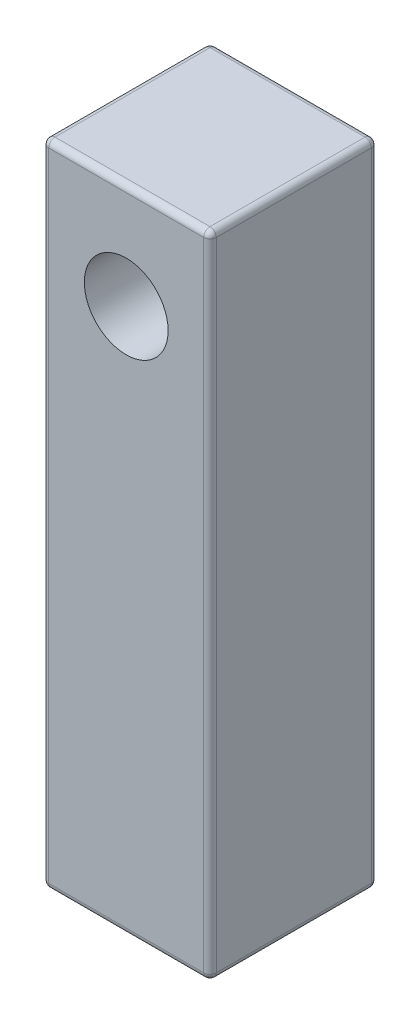
ISO-10303-21;
HEADER;
FILE_DESCRIPTION(('STEP AP214'),'2;1');
FILE_NAME('part.step','',(''),(''),'','','');
FILE_SCHEMA(('AUTOMOTIVE_DESIGN { 1 0 10303 214 1 1 1 1 }'));
ENDSEC;
DATA;
#1=APPLICATION_CONTEXT('core data for automotive mechanical design processes');
#2=APPLICATION_PROTOCOL_DEFINITION('international standard','automotive_design',2000,#1);
#3=PRODUCT_CONTEXT('',#1,'mechanical');
#4=PRODUCT('Part','Part','',(#3));
#5=PRODUCT_RELATED_PRODUCT_CATEGORY('part','',(#4));
#6=PRODUCT_DEFINITION_FORMATION('','',#4);
#7=PRODUCT_DEFINITION_CONTEXT('part definition',#1,'design');
#8=PRODUCT_DEFINITION('design','',#6,#7);
#9=PRODUCT_DEFINITION_SHAPE('','',#8);
#10=(LENGTH_UNIT() NAMED_UNIT(*) SI_UNIT(.MILLI.,.METRE.));
#11=(NAMED_UNIT(*) PLANE_ANGLE_UNIT() SI_UNIT($,.RADIAN.));
#12=(NAMED_UNIT(*) SI_UNIT($,.STERADIAN.) SOLID_ANGLE_UNIT());
#13=UNCERTAINTY_MEASURE_WITH_UNIT(LENGTH_MEASURE(1.E-05),#10,'distance_accuracy_value','');
#14=(GEOMETRIC_REPRESENTATION_CONTEXT(3) GLOBAL_UNCERTAINTY_ASSIGNED_CONTEXT((#13)) GLOBAL_UNIT_ASSIGNED_CONTEXT((#10,
#11,#12)) REPRESENTATION_CONTEXT('',''));
#15=CARTESIAN_POINT('',(0.,0.,0.));
#16=DIRECTION('',(0.,0.,1.));
#17=DIRECTION('',(1.,0.,0.));
#18=AXIS2_PLACEMENT_3D('',#15,#16,#17);
#19=CARTESIAN_POINT('',(4.,31.,-4.));
#20=DIRECTION('',(-1.,0.,0.));
#21=DIRECTION('',(0.,0.,1.));
#22=AXIS2_PLACEMENT_3D('',#19,#20,#21);
#23=PLANE('',#22);
#24=DIRECTION('',(0.,0.,-1.));
#25=VECTOR('',#24,1.);
#26=CARTESIAN_POINT('',(4.,30.7,4.));
#27=LINE('',#26,#25);
#28=CARTESIAN_POINT('',(4.,30.7,-3.7));
#29=VERTEX_POINT('',#28);
#30=CARTESIAN_POINT('',(4.,30.7,3.7));
#31=VERTEX_POINT('',#30);
#32=EDGE_CURVE('E161',#29,#31,#27,.F.);
#33=ORIENTED_EDGE('',*,*,#32,.T.);
#34=DIRECTION('',(0.,-1.,0.));
#35=VECTOR('',#34,1.);
#36=CARTESIAN_POINT('',(4.,31.,3.7));
#37=LINE('',#36,#35);
#38=CARTESIAN_POINT('',(4.,0.300000000000002,3.7));
#39=VERTEX_POINT('',#38);
#40=EDGE_CURVE('E164',#31,#39,#37,.T.);
#41=ORIENTED_EDGE('',*,*,#40,.T.);
#42=DIRECTION('',(0.,0.,-1.));
#43=VECTOR('',#42,1.);
#44=CARTESIAN_POINT('',(4.,0.300000000000002,-4.));
#45=LINE('',#44,#43);
#46=CARTESIAN_POINT('',(4.,0.300000000000002,-3.7));
#47=VERTEX_POINT('',#46);
#48=EDGE_CURVE('E136',#39,#47,#45,.T.);
#49=ORIENTED_EDGE('',*,*,#48,.T.);
#50=DIRECTION('',(0.,-1.,0.));
#51=VECTOR('',#50,1.);
#52=CARTESIAN_POINT('',(4.,31.,-3.7));
#53=LINE('',#52,#51);
#54=EDGE_CURVE('E155',#47,#29,#53,.F.);
#55=ORIENTED_EDGE('',*,*,#54,.T.);
#56=EDGE_LOOP('',(#33,#41,#49,#55));
#57=FACE_BOUND('',#56,.T.);
#58=ADVANCED_FACE('F39',(#57),#23,.F.);
#59=CARTESIAN_POINT('',(-4.,31.,-4.));
#60=DIRECTION('',(0.,0.,1.));
#61=DIRECTION('',(1.,0.,0.));
#62=AXIS2_PLACEMENT_3D('',#59,#60,#61);
#63=PLANE('',#62);
#64=CARTESIAN_POINT('',(0.,26.,-4.));
#65=DIRECTION('',(0.,0.,1.));
#66=DIRECTION('',(1.,0.,0.));
#67=AXIS2_PLACEMENT_3D('',#64,#65,#66);
#68=CIRCLE('',#67,2.);
#69=CARTESIAN_POINT('',(2.,26.,-4.));
#70=VERTEX_POINT('',#69);
#71=EDGE_CURVE('E142',#70,#70,#68,.T.);
#72=ORIENTED_EDGE('',*,*,#71,.T.);
#73=EDGE_LOOP('',(#72));
#74=FACE_BOUND('',#73,.T.);
#75=DIRECTION('',(-1.,0.,0.));
#76=VECTOR('',#75,1.);
#77=CARTESIAN_POINT('',(-4.,0.300000000000002,-4.));
#78=LINE('',#77,#76);
#79=CARTESIAN_POINT('',(3.7,0.300000000000002,-4.));
#80=VERTEX_POINT('',#79);
#81=CARTESIAN_POINT('',(-3.7,0.300000000000002,-4.));
#82=VERTEX_POINT('',#81);
#83=EDGE_CURVE('E183',#80,#82,#78,.T.);
#84=ORIENTED_EDGE('',*,*,#83,.T.);
#85=DIRECTION('',(0.,-1.,0.));
#86=VECTOR('',#85,1.);
#87=CARTESIAN_POINT('',(-3.7,31.,-4.));
#88=LINE('',#87,#86);
#89=CARTESIAN_POINT('',(-3.7,30.7,-4.));
#90=VERTEX_POINT('',#89);
#91=EDGE_CURVE('E186',#82,#90,#88,.F.);
#92=ORIENTED_EDGE('',*,*,#91,.T.);
#93=DIRECTION('',(-1.,0.,0.));
#94=VECTOR('',#93,1.);
#95=CARTESIAN_POINT('',(4.,30.7,-4.));
#96=LINE('',#95,#94);
#97=CARTESIAN_POINT('',(3.7,30.7,-4.));
#98=VERTEX_POINT('',#97);
#99=EDGE_CURVE('E181',#90,#98,#96,.F.);
#100=ORIENTED_EDGE('',*,*,#99,.T.);
#101=DIRECTION('',(0.,-1.,0.));
#102=VECTOR('',#101,1.);
#103=CARTESIAN_POINT('',(3.7,31.,-4.));
#104=LINE('',#103,#102);
#105=EDGE_CURVE('E178',#98,#80,#104,.T.);
#106=ORIENTED_EDGE('',*,*,#105,.T.);
#107=EDGE_LOOP('',(#84,#92,#100,#106));
#108=FACE_BOUND('',#107,.T.);
#109=ADVANCED_FACE('F338',(#74,#108),#63,.F.);
#110=CARTESIAN_POINT('',(-4.,31.,-4.));
#111=DIRECTION('',(1.,0.,0.));
#112=DIRECTION('',(0.,0.,-1.));
#113=AXIS2_PLACEMENT_3D('',#110,#111,#112);
#114=PLANE('',#113);
#115=DIRECTION('',(0.,0.,1.));
#116=VECTOR('',#115,1.);
#117=CARTESIAN_POINT('',(-4.,0.300000000000002,-4.));
#118=LINE('',#117,#116);
#119=CARTESIAN_POINT('',(-4.,0.300000000000002,-3.7));
#120=VERTEX_POINT('',#119);
#121=CARTESIAN_POINT('',(-4.,0.300000000000002,3.7));
#122=VERTEX_POINT('',#121);
#123=EDGE_CURVE('E194',#120,#122,#118,.T.);
#124=ORIENTED_EDGE('',*,*,#123,.T.);
#125=DIRECTION('',(0.,-1.,0.));
#126=VECTOR('',#125,1.);
#127=CARTESIAN_POINT('',(-4.,31.,3.7));
#128=LINE('',#127,#126);
#129=CARTESIAN_POINT('',(-4.,30.7,3.7));
#130=VERTEX_POINT('',#129);
#131=EDGE_CURVE('E197',#122,#130,#128,.F.);
#132=ORIENTED_EDGE('',*,*,#131,.T.);
#133=DIRECTION('',(0.,0.,1.));
#134=VECTOR('',#133,1.);
#135=CARTESIAN_POINT('',(-4.,30.7,-4.));
#136=LINE('',#135,#134);
#137=CARTESIAN_POINT('',(-4.,30.7,-3.7));
#138=VERTEX_POINT('',#137);
#139=EDGE_CURVE('E192',#130,#138,#136,.F.);
#140=ORIENTED_EDGE('',*,*,#139,.T.);
#141=DIRECTION('',(0.,-1.,0.));
#142=VECTOR('',#141,1.);
#143=CARTESIAN_POINT('',(-4.,31.,-3.7));
#144=LINE('',#143,#142);
#145=EDGE_CURVE('E189',#138,#120,#144,.T.);
#146=ORIENTED_EDGE('',*,*,#145,.T.);
#147=EDGE_LOOP('',(#124,#132,#140,#146));
#148=FACE_BOUND('',#147,.T.);
#149=ADVANCED_FACE('F308',(#148),#114,.F.);
#150=CARTESIAN_POINT('',(-4.,31.,4.));
#151=DIRECTION('',(0.,0.,-1.));
#152=DIRECTION('',(-1.,0.,0.));
#153=AXIS2_PLACEMENT_3D('',#150,#151,#152);
#154=PLANE('',#153);
#155=CARTESIAN_POINT('',(0.,26.,4.));
#156=DIRECTION('',(0.,0.,1.));
#157=DIRECTION('',(1.,0.,0.));
#158=AXIS2_PLACEMENT_3D('',#155,#156,#157);
#159=CIRCLE('',#158,2.);
#160=CARTESIAN_POINT('',(2.,26.,4.));
#161=VERTEX_POINT('',#160);
#162=EDGE_CURVE('E564',#161,#161,#159,.T.);
#163=ORIENTED_EDGE('',*,*,#162,.F.);
#164=EDGE_LOOP('',(#163));
#165=FACE_BOUND('',#164,.T.);
#166=DIRECTION('',(0.,-1.,0.));
#167=VECTOR('',#166,1.);
#168=CARTESIAN_POINT('',(-3.7,31.,4.));
#169=LINE('',#168,#167);
#170=CARTESIAN_POINT('',(-3.7,30.7,4.));
#171=VERTEX_POINT('',#170);
#172=CARTESIAN_POINT('',(-3.7,0.300000000000002,4.));
#173=VERTEX_POINT('',#172);
#174=EDGE_CURVE('E202',#171,#173,#169,.T.);
#175=ORIENTED_EDGE('',*,*,#174,.T.);
#176=DIRECTION('',(1.,0.,0.));
#177=VECTOR('',#176,1.);
#178=CARTESIAN_POINT('',(-4.,0.300000000000002,4.));
#179=LINE('',#178,#177);
#180=CARTESIAN_POINT('',(3.7,0.300000000000002,4.));
#181=VERTEX_POINT('',#180);
#182=EDGE_CURVE('E208',#173,#181,#179,.T.);
#183=ORIENTED_EDGE('',*,*,#182,.T.);
#184=DIRECTION('',(0.,-1.,0.));
#185=VECTOR('',#184,1.);
#186=CARTESIAN_POINT('',(3.7,31.,4.));
#187=LINE('',#186,#185);
#188=CARTESIAN_POINT('',(3.7,30.7,4.));
#189=VERTEX_POINT('',#188);
#190=EDGE_CURVE('E205',#181,#189,#187,.F.);
#191=ORIENTED_EDGE('',*,*,#190,.T.);
#192=DIRECTION('',(1.,0.,0.));
#193=VECTOR('',#192,1.);
#194=CARTESIAN_POINT('',(-4.,30.7,4.));
#195=LINE('',#194,#193);
#196=EDGE_CURVE('E200',#189,#171,#195,.F.);
#197=ORIENTED_EDGE('',*,*,#196,.T.);
#198=EDGE_LOOP('',(#175,#183,#191,#197));
#199=FACE_BOUND('',#198,.T.);
#200=ADVANCED_FACE('F284',(#165,#199),#154,.F.);
#201=CARTESIAN_POINT('',(0.,31.,0.));
#202=DIRECTION('',(0.,1.,0.));
#203=DIRECTION('',(0.,0.,1.));
#204=AXIS2_PLACEMENT_3D('',#201,#202,#203);
#205=PLANE('',#204);
#206=DIRECTION('',(1.,0.,0.));
#207=VECTOR('',#206,1.);
#208=CARTESIAN_POINT('',(4.,31.,3.7));
#209=LINE('',#208,#207);
#210=CARTESIAN_POINT('',(-3.7,31.,3.7));
#211=VERTEX_POINT('',#210);
#212=CARTESIAN_POINT('',(3.7,31.,3.7));
#213=VERTEX_POINT('',#212);
#214=EDGE_CURVE('E211',#211,#213,#209,.T.);
#215=ORIENTED_EDGE('',*,*,#214,.T.);
#216=DIRECTION('',(0.,0.,-1.));
#217=VECTOR('',#216,1.);
#218=CARTESIAN_POINT('',(3.7,31.,-4.));
#219=LINE('',#218,#217);
#220=CARTESIAN_POINT('',(3.7,31.,-3.7));
#221=VERTEX_POINT('',#220);
#222=EDGE_CURVE('E11',#213,#221,#219,.T.);
#223=ORIENTED_EDGE('',*,*,#222,.T.);
#224=DIRECTION('',(-1.,0.,0.));
#225=VECTOR('',#224,1.);
#226=CARTESIAN_POINT('',(-4.,31.,-3.7));
#227=LINE('',#226,#225);
#228=CARTESIAN_POINT('',(-3.7,31.,-3.7));
#229=VERTEX_POINT('',#228);
#230=EDGE_CURVE('E48',#221,#229,#227,.T.);
#231=ORIENTED_EDGE('',*,*,#230,.T.);
#232=DIRECTION('',(0.,0.,1.));
#233=VECTOR('',#232,1.);
#234=CARTESIAN_POINT('',(-3.7,31.,4.));
#235=LINE('',#234,#233);
#236=EDGE_CURVE('E213',#229,#211,#235,.T.);
#237=ORIENTED_EDGE('',*,*,#236,.T.);
#238=EDGE_LOOP('',(#215,#223,#231,#237));
#239=FACE_BOUND('',#238,.T.);
#240=ADVANCED_FACE('F292',(#239),#205,.T.);
#241=CARTESIAN_POINT('',(0.,0.,0.));
#242=DIRECTION('',(0.,1.,0.));
#243=DIRECTION('',(0.,0.,1.));
#244=AXIS2_PLACEMENT_3D('',#241,#242,#243);
#245=PLANE('',#244);
#246=DIRECTION('',(-1.,0.,0.));
#247=VECTOR('',#246,1.);
#248=CARTESIAN_POINT('',(0.,0.,-3.7));
#249=LINE('',#248,#247);
#250=CARTESIAN_POINT('',(-3.7,0.,-3.7));
#251=VERTEX_POINT('',#250);
#252=CARTESIAN_POINT('',(3.7,0.,-3.7));
#253=VERTEX_POINT('',#252);
#254=EDGE_CURVE('E175',#251,#253,#249,.F.);
#255=ORIENTED_EDGE('',*,*,#254,.T.);
#256=DIRECTION('',(0.,0.,-1.));
#257=VECTOR('',#256,1.);
#258=CARTESIAN_POINT('',(3.7,0.,0.));
#259=LINE('',#258,#257);
#260=CARTESIAN_POINT('',(3.7,0.,3.7));
#261=VERTEX_POINT('',#260);
#262=EDGE_CURVE('E138',#253,#261,#259,.F.);
#263=ORIENTED_EDGE('',*,*,#262,.T.);
#264=DIRECTION('',(1.,0.,0.));
#265=VECTOR('',#264,1.);
#266=CARTESIAN_POINT('',(0.,0.,3.7));
#267=LINE('',#266,#265);
#268=CARTESIAN_POINT('',(-3.7,0.,3.7));
#269=VERTEX_POINT('',#268);
#270=EDGE_CURVE('E168',#261,#269,#267,.F.);
#271=ORIENTED_EDGE('',*,*,#270,.T.);
#272=DIRECTION('',(0.,0.,1.));
#273=VECTOR('',#272,1.);
#274=CARTESIAN_POINT('',(-3.7,0.,0.));
#275=LINE('',#274,#273);
#276=EDGE_CURVE('E173',#269,#251,#275,.F.);
#277=ORIENTED_EDGE('',*,*,#276,.T.);
#278=EDGE_LOOP('',(#255,#263,#271,#277));
#279=FACE_BOUND('',#278,.T.);
#280=ADVANCED_FACE('F372',(#279),#245,.F.);
#281=CARTESIAN_POINT('',(-3.7,30.7,0.));
#282=DIRECTION('',(0.,0.,-1.));
#283=DIRECTION('',(-1.,0.,0.));
#284=AXIS2_PLACEMENT_3D('',#281,#282,#283);
#285=CYLINDRICAL_SURFACE('',#284,0.3);
#286=CARTESIAN_POINT('',(-3.7,30.7,3.7));
#287=DIRECTION('',(0.,0.,1.));
#288=DIRECTION('',(1.,0.,0.));
#289=AXIS2_PLACEMENT_3D('',#286,#287,#288);
#290=CIRCLE('',#289,0.3);
#291=EDGE_CURVE('E43',#211,#130,#290,.T.);
#292=ORIENTED_EDGE('',*,*,#291,.F.);
#293=ORIENTED_EDGE('',*,*,#236,.F.);
#294=CARTESIAN_POINT('',(-3.7,30.7,-3.7));
#295=DIRECTION('',(0.,0.,-1.));
#296=DIRECTION('',(-1.,0.,0.));
#297=AXIS2_PLACEMENT_3D('',#294,#295,#296);
#298=CIRCLE('',#297,0.3);
#299=EDGE_CURVE('E262',#138,#229,#298,.T.);
#300=ORIENTED_EDGE('',*,*,#299,.F.);
#301=ORIENTED_EDGE('',*,*,#139,.F.);
#302=EDGE_LOOP('',(#292,#293,#300,#301));
#303=FACE_BOUND('',#302,.T.);
#304=ADVANCED_FACE('F41',(#303),#285,.T.);
#305=CARTESIAN_POINT('',(-3.7,30.7,3.7));
#306=DIRECTION('',(0.,0.,1.));
#307=DIRECTION('',(1.,0.,0.));
#308=AXIS2_PLACEMENT_3D('',#305,#306,#307);
#309=SPHERICAL_SURFACE('',#308,0.3);
#310=CARTESIAN_POINT('',(-3.7,30.7,3.7));
#311=DIRECTION('',(-1.,0.,0.));
#312=DIRECTION('',(0.,0.,1.));
#313=AXIS2_PLACEMENT_3D('',#310,#311,#312);
#314=CIRCLE('',#313,0.3);
#315=EDGE_CURVE('E257',#211,#171,#314,.F.);
#316=ORIENTED_EDGE('',*,*,#315,.F.);
#317=ORIENTED_EDGE('',*,*,#291,.T.);
#318=CARTESIAN_POINT('',(-3.7,30.7,3.7));
#319=DIRECTION('',(0.,1.,0.));
#320=DIRECTION('',(0.,0.,1.));
#321=AXIS2_PLACEMENT_3D('',#318,#319,#320);
#322=CIRCLE('',#321,0.3);
#323=EDGE_CURVE('E260',#171,#130,#322,.F.);
#324=ORIENTED_EDGE('',*,*,#323,.F.);
#325=EDGE_LOOP('',(#316,#317,#324));
#326=FACE_BOUND('',#325,.T.);
#327=ADVANCED_FACE('F273',(#326),#309,.T.);
#328=CARTESIAN_POINT('',(-3.7,30.7,-3.7));
#329=DIRECTION('',(0.,0.,1.));
#330=DIRECTION('',(1.,0.,0.));
#331=AXIS2_PLACEMENT_3D('',#328,#329,#330);
#332=SPHERICAL_SURFACE('',#331,0.3);
#333=CARTESIAN_POINT('',(-3.7,30.7,-3.7));
#334=DIRECTION('',(0.,1.,0.));
#335=DIRECTION('',(0.,0.,1.));
#336=AXIS2_PLACEMENT_3D('',#333,#334,#335);
#337=CIRCLE('',#336,0.3);
#338=EDGE_CURVE('E251',#138,#90,#337,.F.);
#339=ORIENTED_EDGE('',*,*,#338,.F.);
#340=ORIENTED_EDGE('',*,*,#299,.T.);
#341=CARTESIAN_POINT('',(-3.7,30.7,-3.7));
#342=DIRECTION('',(-1.,0.,0.));
#343=DIRECTION('',(0.,0.,1.));
#344=AXIS2_PLACEMENT_3D('',#341,#342,#343);
#345=CIRCLE('',#344,0.3);
#346=EDGE_CURVE('E254',#90,#229,#345,.F.);
#347=ORIENTED_EDGE('',*,*,#346,.F.);
#348=EDGE_LOOP('',(#339,#340,#347));
#349=FACE_BOUND('',#348,.T.);
#350=ADVANCED_FACE('F300',(#349),#332,.T.);
#351=CARTESIAN_POINT('',(-3.7,31.,3.7));
#352=DIRECTION('',(0.,-1.,0.));
#353=DIRECTION('',(0.,0.,-1.));
#354=AXIS2_PLACEMENT_3D('',#351,#352,#353);
#355=CYLINDRICAL_SURFACE('',#354,0.3);
#356=ORIENTED_EDGE('',*,*,#323,.T.);
#357=ORIENTED_EDGE('',*,*,#131,.F.);
#358=CARTESIAN_POINT('',(-3.7,0.300000000000002,3.7));
#359=DIRECTION('',(0.,-1.,0.));
#360=DIRECTION('',(0.,0.,-1.));
#361=AXIS2_PLACEMENT_3D('',#358,#359,#360);
#362=CIRCLE('',#361,0.3);
#363=EDGE_CURVE('E246',#173,#122,#362,.T.);
#364=ORIENTED_EDGE('',*,*,#363,.F.);
#365=ORIENTED_EDGE('',*,*,#174,.F.);
#366=EDGE_LOOP('',(#356,#357,#364,#365));
#367=FACE_BOUND('',#366,.T.);
#368=ADVANCED_FACE('F280',(#367),#355,.T.);
#369=CARTESIAN_POINT('',(0.,30.7,3.7));
#370=DIRECTION('',(-1.,0.,0.));
#371=DIRECTION('',(0.,0.,1.));
#372=AXIS2_PLACEMENT_3D('',#369,#370,#371);
#373=CYLINDRICAL_SURFACE('',#372,0.3);
#374=ORIENTED_EDGE('',*,*,#315,.T.);
#375=ORIENTED_EDGE('',*,*,#196,.F.);
#376=CARTESIAN_POINT('',(3.7,30.7,3.7));
#377=DIRECTION('',(1.,0.,0.));
#378=DIRECTION('',(0.,0.,-1.));
#379=AXIS2_PLACEMENT_3D('',#376,#377,#378);
#380=CIRCLE('',#379,0.3);
#381=EDGE_CURVE('E243',#213,#189,#380,.T.);
#382=ORIENTED_EDGE('',*,*,#381,.F.);
#383=ORIENTED_EDGE('',*,*,#214,.F.);
#384=EDGE_LOOP('',(#374,#375,#382,#383));
#385=FACE_BOUND('',#384,.T.);
#386=ADVANCED_FACE('F290',(#385),#373,.T.);
#387=CARTESIAN_POINT('',(3.7,30.7,0.));
#388=DIRECTION('',(0.,0.,1.));
#389=DIRECTION('',(1.,0.,0.));
#390=AXIS2_PLACEMENT_3D('',#387,#388,#389);
#391=CYLINDRICAL_SURFACE('',#390,0.3);
#392=CARTESIAN_POINT('',(3.7,30.7,-3.7));
#393=DIRECTION('',(0.,0.,-1.));
#394=DIRECTION('',(-1.,0.,0.));
#395=AXIS2_PLACEMENT_3D('',#392,#393,#394);
#396=CIRCLE('',#395,0.3);
#397=EDGE_CURVE('E238',#221,#29,#396,.T.);
#398=ORIENTED_EDGE('',*,*,#397,.F.);
#399=ORIENTED_EDGE('',*,*,#222,.F.);
#400=CARTESIAN_POINT('',(3.7,30.7,3.7));
#401=DIRECTION('',(0.,0.,1.));
#402=DIRECTION('',(1.,0.,0.));
#403=AXIS2_PLACEMENT_3D('',#400,#401,#402);
#404=CIRCLE('',#403,0.3);
#405=EDGE_CURVE('E240',#31,#213,#404,.T.);
#406=ORIENTED_EDGE('',*,*,#405,.F.);
#407=ORIENTED_EDGE('',*,*,#32,.F.);
#408=EDGE_LOOP('',(#398,#399,#406,#407));
#409=FACE_BOUND('',#408,.T.);
#410=ADVANCED_FACE('F295',(#409),#391,.T.);
#411=CARTESIAN_POINT('',(0.,30.7,-3.7));
#412=DIRECTION('',(1.,0.,0.));
#413=DIRECTION('',(0.,0.,-1.));
#414=AXIS2_PLACEMENT_3D('',#411,#412,#413);
#415=CYLINDRICAL_SURFACE('',#414,0.3);
#416=ORIENTED_EDGE('',*,*,#346,.T.);
#417=ORIENTED_EDGE('',*,*,#230,.F.);
#418=CARTESIAN_POINT('',(3.7,30.7,-3.7));
#419=DIRECTION('',(1.,0.,0.));
#420=DIRECTION('',(0.,0.,-1.));
#421=AXIS2_PLACEMENT_3D('',#418,#419,#420);
#422=CIRCLE('',#421,0.3);
#423=EDGE_CURVE('E56',#98,#221,#422,.T.);
#424=ORIENTED_EDGE('',*,*,#423,.F.);
#425=ORIENTED_EDGE('',*,*,#99,.F.);
#426=EDGE_LOOP('',(#416,#417,#424,#425));
#427=FACE_BOUND('',#426,.T.);
#428=ADVANCED_FACE('F298',(#427),#415,.T.);
#429=CARTESIAN_POINT('',(-3.7,31.,-3.7));
#430=DIRECTION('',(0.,-1.,0.));
#431=DIRECTION('',(0.,0.,-1.));
#432=AXIS2_PLACEMENT_3D('',#429,#430,#431);
#433=CYLINDRICAL_SURFACE('',#432,0.3);
#434=ORIENTED_EDGE('',*,*,#338,.T.);
#435=ORIENTED_EDGE('',*,*,#91,.F.);
#436=CARTESIAN_POINT('',(-3.7,0.300000000000002,-3.7));
#437=DIRECTION('',(0.,-1.,0.));
#438=DIRECTION('',(0.,0.,-1.));
#439=AXIS2_PLACEMENT_3D('',#436,#437,#438);
#440=CIRCLE('',#439,0.3);
#441=EDGE_CURVE('E234',#120,#82,#440,.T.);
#442=ORIENTED_EDGE('',*,*,#441,.F.);
#443=ORIENTED_EDGE('',*,*,#145,.F.);
#444=EDGE_LOOP('',(#434,#435,#442,#443));
#445=FACE_BOUND('',#444,.T.);
#446=ADVANCED_FACE('F305',(#445),#433,.T.);
#447=CARTESIAN_POINT('',(-3.7,0.300000000000002,-4.));
#448=DIRECTION('',(0.,0.,1.));
#449=DIRECTION('',(1.,0.,0.));
#450=AXIS2_PLACEMENT_3D('',#447,#448,#449);
#451=CYLINDRICAL_SURFACE('',#450,0.3);
#452=CARTESIAN_POINT('',(-3.7,0.300000000000002,3.7));
#453=DIRECTION('',(0.,0.,1.));
#454=DIRECTION('',(1.,0.,0.));
#455=AXIS2_PLACEMENT_3D('',#452,#453,#454);
#456=CIRCLE('',#455,0.3);
#457=EDGE_CURVE('E248',#122,#269,#456,.T.);
#458=ORIENTED_EDGE('',*,*,#457,.F.);
#459=ORIENTED_EDGE('',*,*,#123,.F.);
#460=CARTESIAN_POINT('',(-3.7,0.3,-3.7));
#461=DIRECTION('',(0.,0.,-1.));
#462=DIRECTION('',(-1.,0.,0.));
#463=AXIS2_PLACEMENT_3D('',#460,#461,#462);
#464=CIRCLE('',#463,0.3);
#465=EDGE_CURVE('E231',#251,#120,#464,.T.);
#466=ORIENTED_EDGE('',*,*,#465,.F.);
#467=ORIENTED_EDGE('',*,*,#276,.F.);
#468=EDGE_LOOP('',(#458,#459,#466,#467));
#469=FACE_BOUND('',#468,.T.);
#470=ADVANCED_FACE('F312',(#469),#451,.T.);
#471=CARTESIAN_POINT('',(-3.7,0.3,3.7));
#472=DIRECTION('',(0.,0.,1.));
#473=DIRECTION('',(1.,0.,0.));
#474=AXIS2_PLACEMENT_3D('',#471,#472,#473);
#475=SPHERICAL_SURFACE('',#474,0.3);
#476=ORIENTED_EDGE('',*,*,#363,.T.);
#477=ORIENTED_EDGE('',*,*,#457,.T.);
#478=CARTESIAN_POINT('',(-3.7,0.3,3.7));
#479=DIRECTION('',(-1.,0.,0.));
#480=DIRECTION('',(0.,0.,1.));
#481=AXIS2_PLACEMENT_3D('',#478,#479,#480);
#482=CIRCLE('',#481,0.3);
#483=EDGE_CURVE('E228',#173,#269,#482,.F.);
#484=ORIENTED_EDGE('',*,*,#483,.F.);
#485=EDGE_LOOP('',(#476,#477,#484));
#486=FACE_BOUND('',#485,.T.);
#487=ADVANCED_FACE('F316',(#486),#475,.T.);
#488=CARTESIAN_POINT('',(3.7,30.7,3.7));
#489=DIRECTION('',(0.,0.,1.));
#490=DIRECTION('',(1.,0.,0.));
#491=AXIS2_PLACEMENT_3D('',#488,#489,#490);
#492=SPHERICAL_SURFACE('',#491,0.3);
#493=ORIENTED_EDGE('',*,*,#405,.T.);
#494=ORIENTED_EDGE('',*,*,#381,.T.);
#495=CARTESIAN_POINT('',(3.7,30.7,3.7));
#496=DIRECTION('',(0.,1.,0.));
#497=DIRECTION('',(0.,0.,1.));
#498=AXIS2_PLACEMENT_3D('',#495,#496,#497);
#499=CIRCLE('',#498,0.3);
#500=EDGE_CURVE('E225',#31,#189,#499,.F.);
#501=ORIENTED_EDGE('',*,*,#500,.F.);
#502=EDGE_LOOP('',(#493,#494,#501));
#503=FACE_BOUND('',#502,.T.);
#504=ADVANCED_FACE('F326',(#503),#492,.T.);
#505=CARTESIAN_POINT('',(3.7,30.7,-3.7));
#506=DIRECTION('',(0.,0.,1.));
#507=DIRECTION('',(1.,0.,0.));
#508=AXIS2_PLACEMENT_3D('',#505,#506,#507);
#509=SPHERICAL_SURFACE('',#508,0.3);
#510=ORIENTED_EDGE('',*,*,#423,.T.);
#511=ORIENTED_EDGE('',*,*,#397,.T.);
#512=CARTESIAN_POINT('',(3.7,30.7,-3.7));
#513=DIRECTION('',(0.,1.,0.));
#514=DIRECTION('',(0.,0.,1.));
#515=AXIS2_PLACEMENT_3D('',#512,#513,#514);
#516=CIRCLE('',#515,0.3);
#517=EDGE_CURVE('E157',#98,#29,#516,.F.);
#518=ORIENTED_EDGE('',*,*,#517,.F.);
#519=EDGE_LOOP('',(#510,#511,#518));
#520=FACE_BOUND('',#519,.T.);
#521=ADVANCED_FACE('F328',(#520),#509,.T.);
#522=CARTESIAN_POINT('',(-3.7,0.3,-3.7));
#523=DIRECTION('',(0.,0.,1.));
#524=DIRECTION('',(1.,0.,0.));
#525=AXIS2_PLACEMENT_3D('',#522,#523,#524);
#526=SPHERICAL_SURFACE('',#525,0.3);
#527=ORIENTED_EDGE('',*,*,#465,.T.);
#528=ORIENTED_EDGE('',*,*,#441,.T.);
#529=CARTESIAN_POINT('',(-3.7,0.300000000000002,-3.7));
#530=DIRECTION('',(-1.,0.,0.));
#531=DIRECTION('',(0.,0.,1.));
#532=AXIS2_PLACEMENT_3D('',#529,#530,#531);
#533=CIRCLE('',#532,0.3);
#534=EDGE_CURVE('E222',#251,#82,#533,.F.);
#535=ORIENTED_EDGE('',*,*,#534,.F.);
#536=EDGE_LOOP('',(#527,#528,#535));
#537=FACE_BOUND('',#536,.T.);
#538=ADVANCED_FACE('F334',(#537),#526,.T.);
#539=CARTESIAN_POINT('',(-4.,0.300000000000002,3.7));
#540=DIRECTION('',(1.,0.,0.));
#541=DIRECTION('',(0.,0.,-1.));
#542=AXIS2_PLACEMENT_3D('',#539,#540,#541);
#543=CYLINDRICAL_SURFACE('',#542,0.3);
#544=ORIENTED_EDGE('',*,*,#483,.T.);
#545=ORIENTED_EDGE('',*,*,#270,.F.);
#546=CARTESIAN_POINT('',(3.7,0.300000000000002,3.7));
#547=DIRECTION('',(1.,0.,0.));
#548=DIRECTION('',(0.,0.,-1.));
#549=AXIS2_PLACEMENT_3D('',#546,#547,#548);
#550=CIRCLE('',#549,0.3);
#551=EDGE_CURVE('E219',#181,#261,#550,.T.);
#552=ORIENTED_EDGE('',*,*,#551,.F.);
#553=ORIENTED_EDGE('',*,*,#182,.F.);
#554=EDGE_LOOP('',(#544,#545,#552,#553));
#555=FACE_BOUND('',#554,.T.);
#556=ADVANCED_FACE('F319',(#555),#543,.T.);
#557=CARTESIAN_POINT('',(3.7,31.,3.7));
#558=DIRECTION('',(0.,-1.,0.));
#559=DIRECTION('',(0.,0.,-1.));
#560=AXIS2_PLACEMENT_3D('',#557,#558,#559);
#561=CYLINDRICAL_SURFACE('',#560,0.3);
#562=ORIENTED_EDGE('',*,*,#500,.T.);
#563=ORIENTED_EDGE('',*,*,#190,.F.);
#564=CARTESIAN_POINT('',(3.7,0.300000000000002,3.7));
#565=DIRECTION('',(0.,-1.,0.));
#566=DIRECTION('',(0.,0.,-1.));
#567=AXIS2_PLACEMENT_3D('',#564,#565,#566);
#568=CIRCLE('',#567,0.3);
#569=EDGE_CURVE('E152',#39,#181,#568,.T.);
#570=ORIENTED_EDGE('',*,*,#569,.F.);
#571=ORIENTED_EDGE('',*,*,#40,.F.);
#572=EDGE_LOOP('',(#562,#563,#570,#571));
#573=FACE_BOUND('',#572,.T.);
#574=ADVANCED_FACE('F324',(#573),#561,.T.);
#575=CARTESIAN_POINT('',(3.7,31.,-3.7));
#576=DIRECTION('',(0.,-1.,0.));
#577=DIRECTION('',(0.,0.,-1.));
#578=AXIS2_PLACEMENT_3D('',#575,#576,#577);
#579=CYLINDRICAL_SURFACE('',#578,0.3);
#580=ORIENTED_EDGE('',*,*,#517,.T.);
#581=ORIENTED_EDGE('',*,*,#54,.F.);
#582=CARTESIAN_POINT('',(3.7,0.300000000000002,-3.7));
#583=DIRECTION('',(0.,-1.,0.));
#584=DIRECTION('',(0.,0.,-1.));
#585=AXIS2_PLACEMENT_3D('',#582,#583,#584);
#586=CIRCLE('',#585,0.3);
#587=EDGE_CURVE('E145',#80,#47,#586,.T.);
#588=ORIENTED_EDGE('',*,*,#587,.F.);
#589=ORIENTED_EDGE('',*,*,#105,.F.);
#590=EDGE_LOOP('',(#580,#581,#588,#589));
#591=FACE_BOUND('',#590,.T.);
#592=ADVANCED_FACE('F156',(#591),#579,.T.);
#593=CARTESIAN_POINT('',(-4.,0.300000000000002,-3.7));
#594=DIRECTION('',(-1.,0.,0.));
#595=DIRECTION('',(0.,0.,1.));
#596=AXIS2_PLACEMENT_3D('',#593,#594,#595);
#597=CYLINDRICAL_SURFACE('',#596,0.3);
#598=ORIENTED_EDGE('',*,*,#534,.T.);
#599=ORIENTED_EDGE('',*,*,#83,.F.);
#600=CARTESIAN_POINT('',(3.7,0.3,-3.7));
#601=DIRECTION('',(1.,0.,0.));
#602=DIRECTION('',(0.,0.,-1.));
#603=AXIS2_PLACEMENT_3D('',#600,#601,#602);
#604=CIRCLE('',#603,0.3);
#605=EDGE_CURVE('E149',#253,#80,#604,.T.);
#606=ORIENTED_EDGE('',*,*,#605,.F.);
#607=ORIENTED_EDGE('',*,*,#254,.F.);
#608=EDGE_LOOP('',(#598,#599,#606,#607));
#609=FACE_BOUND('',#608,.T.);
#610=ADVANCED_FACE('F355',(#609),#597,.T.);
#611=CARTESIAN_POINT('',(3.7,0.3,3.7));
#612=DIRECTION('',(0.,0.,1.));
#613=DIRECTION('',(1.,0.,0.));
#614=AXIS2_PLACEMENT_3D('',#611,#612,#613);
#615=SPHERICAL_SURFACE('',#614,0.3);
#616=ORIENTED_EDGE('',*,*,#569,.T.);
#617=ORIENTED_EDGE('',*,*,#551,.T.);
#618=CARTESIAN_POINT('',(3.7,0.3,3.7));
#619=DIRECTION('',(0.,0.,1.));
#620=DIRECTION('',(1.,0.,0.));
#621=AXIS2_PLACEMENT_3D('',#618,#619,#620);
#622=CIRCLE('',#621,0.3);
#623=EDGE_CURVE('E141',#39,#261,#622,.F.);
#624=ORIENTED_EDGE('',*,*,#623,.F.);
#625=EDGE_LOOP('',(#616,#617,#624));
#626=FACE_BOUND('',#625,.T.);
#627=ADVANCED_FACE('F352',(#626),#615,.T.);
#628=CARTESIAN_POINT('',(3.7,0.3,-3.7));
#629=DIRECTION('',(0.,0.,1.));
#630=DIRECTION('',(1.,0.,0.));
#631=AXIS2_PLACEMENT_3D('',#628,#629,#630);
#632=SPHERICAL_SURFACE('',#631,0.3);
#633=ORIENTED_EDGE('',*,*,#605,.T.);
#634=ORIENTED_EDGE('',*,*,#587,.T.);
#635=CARTESIAN_POINT('',(3.7,0.300000000000002,-3.7));
#636=DIRECTION('',(0.,0.,-1.));
#637=DIRECTION('',(-1.,0.,0.));
#638=AXIS2_PLACEMENT_3D('',#635,#636,#637);
#639=CIRCLE('',#638,0.3);
#640=EDGE_CURVE('E132',#253,#47,#639,.F.);
#641=ORIENTED_EDGE('',*,*,#640,.F.);
#642=EDGE_LOOP('',(#633,#634,#641));
#643=FACE_BOUND('',#642,.T.);
#644=ADVANCED_FACE('F147',(#643),#632,.T.);
#645=CARTESIAN_POINT('',(3.7,0.300000000000002,-4.));
#646=DIRECTION('',(0.,0.,-1.));
#647=DIRECTION('',(-1.,0.,0.));
#648=AXIS2_PLACEMENT_3D('',#645,#646,#647);
#649=CYLINDRICAL_SURFACE('',#648,0.3);
#650=ORIENTED_EDGE('',*,*,#623,.T.);
#651=ORIENTED_EDGE('',*,*,#262,.F.);
#652=ORIENTED_EDGE('',*,*,#640,.T.);
#653=ORIENTED_EDGE('',*,*,#48,.F.);
#654=EDGE_LOOP('',(#650,#651,#652,#653));
#655=FACE_BOUND('',#654,.T.);
#656=ADVANCED_FACE('F134',(#655),#649,.T.);
#657=CARTESIAN_POINT('',(0.,26.,-4.));
#658=DIRECTION('',(0.,0.,1.));
#659=DIRECTION('',(1.,0.,0.));
#660=AXIS2_PLACEMENT_3D('',#657,#658,#659);
#661=CYLINDRICAL_SURFACE('',#660,2.);
#662=ORIENTED_EDGE('',*,*,#71,.F.);
#663=EDGE_LOOP('',(#662));
#664=FACE_BOUND('',#663,.T.);
#665=ORIENTED_EDGE('',*,*,#162,.T.);
#666=EDGE_LOOP('',(#665));
#667=FACE_BOUND('',#666,.T.);
#668=ADVANCED_FACE('F349',(#664,#667),#661,.F.);
#669=CLOSED_SHELL('',(#58,#109,#149,#200,#240,#280,#304,#327,#350,#368,#386,#410,#428,#446,#470,
#487,#504,#521,#538,#556,#574,#592,#610,#627,#644,#656,#668));
#670=MANIFOLD_SOLID_BREP('B2',#669);
#671=ADVANCED_BREP_SHAPE_REPRESENTATION('',(#18,#670),#14);
#672=SHAPE_DEFINITION_REPRESENTATION(#9,#671);
ENDSEC;
END-ISO-10303-21;
